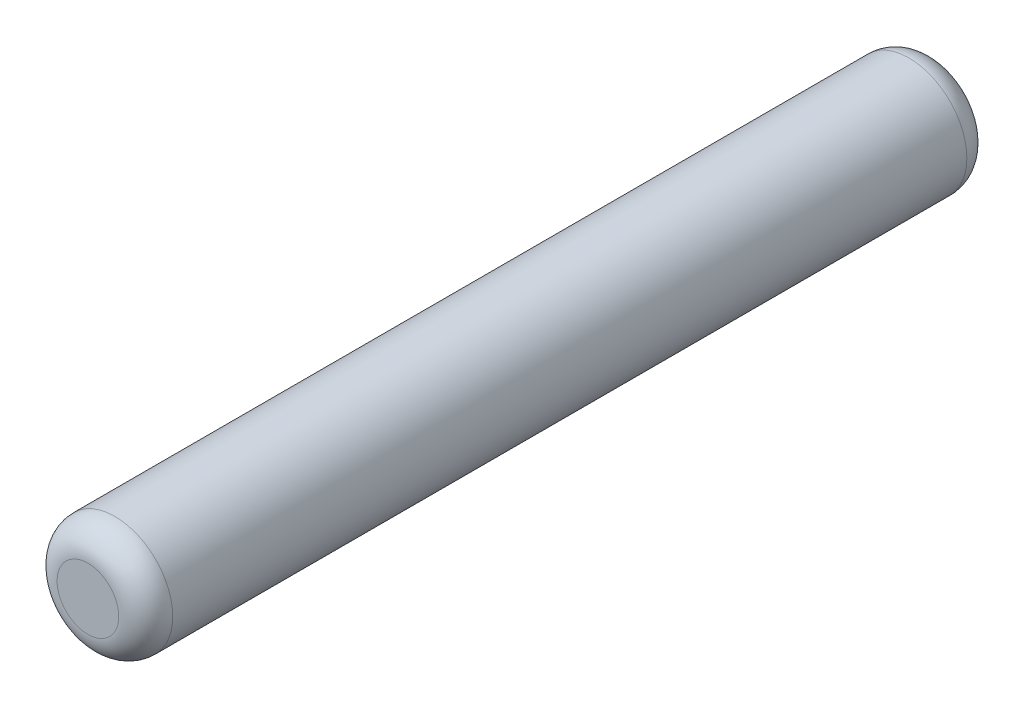
ISO-10303-21;
HEADER;
FILE_DESCRIPTION(('STEP AP214'),'2;1');
FILE_NAME('part.step','',(''),(''),'','','');
FILE_SCHEMA(('AUTOMOTIVE_DESIGN { 1 0 10303 214 1 1 1 1 }'));
ENDSEC;
DATA;
#1=APPLICATION_CONTEXT('core data for automotive mechanical design processes');
#2=APPLICATION_PROTOCOL_DEFINITION('international standard','automotive_design',2000,#1);
#3=PRODUCT_CONTEXT('',#1,'mechanical');
#4=PRODUCT('Part','Part','',(#3));
#5=PRODUCT_RELATED_PRODUCT_CATEGORY('part','',(#4));
#6=PRODUCT_DEFINITION_FORMATION('','',#4);
#7=PRODUCT_DEFINITION_CONTEXT('part definition',#1,'design');
#8=PRODUCT_DEFINITION('design','',#6,#7);
#9=PRODUCT_DEFINITION_SHAPE('','',#8);
#10=(LENGTH_UNIT() NAMED_UNIT(*) SI_UNIT(.MILLI.,.METRE.));
#11=(NAMED_UNIT(*) PLANE_ANGLE_UNIT() SI_UNIT($,.RADIAN.));
#12=(NAMED_UNIT(*) SI_UNIT($,.STERADIAN.) SOLID_ANGLE_UNIT());
#13=UNCERTAINTY_MEASURE_WITH_UNIT(LENGTH_MEASURE(1.E-05),#10,'distance_accuracy_value','');
#14=(GEOMETRIC_REPRESENTATION_CONTEXT(3) GLOBAL_UNCERTAINTY_ASSIGNED_CONTEXT((#13)) GLOBAL_UNIT_ASSIGNED_CONTEXT((#10,
#11,#12)) REPRESENTATION_CONTEXT('',''));
#15=CARTESIAN_POINT('',(0.,0.,0.));
#16=DIRECTION('',(0.,0.,1.));
#17=DIRECTION('',(1.,0.,0.));
#18=AXIS2_PLACEMENT_3D('',#15,#16,#17);
#19=CARTESIAN_POINT('',(0.,0.,5.5));
#20=DIRECTION('',(0.,0.,-1.));
#21=DIRECTION('',(-1.,0.,0.));
#22=AXIS2_PLACEMENT_3D('',#19,#20,#21);
#23=CYLINDRICAL_SURFACE('',#22,0.75);
#24=CARTESIAN_POINT('',(0.,0.,-5.15));
#25=DIRECTION('',(0.,0.,1.));
#26=DIRECTION('',(1.,0.,0.));
#27=AXIS2_PLACEMENT_3D('',#24,#25,#26);
#28=CIRCLE('',#27,0.75);
#29=CARTESIAN_POINT('',(0.75,0.,-5.15));
#30=VERTEX_POINT('',#29);
#31=EDGE_CURVE('E42',#30,#30,#28,.T.);
#32=ORIENTED_EDGE('',*,*,#31,.T.);
#33=EDGE_LOOP('',(#32));
#34=FACE_BOUND('',#33,.T.);
#35=CARTESIAN_POINT('',(0.,0.,5.15));
#36=DIRECTION('',(0.,0.,1.));
#37=DIRECTION('',(1.,0.,0.));
#38=AXIS2_PLACEMENT_3D('',#35,#36,#37);
#39=CIRCLE('',#38,0.75);
#40=CARTESIAN_POINT('',(0.75,0.,5.15));
#41=VERTEX_POINT('',#40);
#42=EDGE_CURVE('E46',#41,#41,#39,.F.);
#43=ORIENTED_EDGE('',*,*,#42,.T.);
#44=EDGE_LOOP('',(#43));
#45=FACE_BOUND('',#44,.T.);
#46=ADVANCED_FACE('F31',(#34,#45),#23,.T.);
#47=CARTESIAN_POINT('',(0.,0.,5.5));
#48=DIRECTION('',(0.,0.,1.));
#49=DIRECTION('',(1.,0.,0.));
#50=AXIS2_PLACEMENT_3D('',#47,#48,#49);
#51=PLANE('',#50);
#52=CARTESIAN_POINT('',(0.,0.,5.5));
#53=DIRECTION('',(0.,0.,1.));
#54=DIRECTION('',(1.,0.,0.));
#55=AXIS2_PLACEMENT_3D('',#52,#53,#54);
#56=CIRCLE('',#55,0.4);
#57=CARTESIAN_POINT('',(0.4,0.,5.5));
#58=VERTEX_POINT('',#57);
#59=EDGE_CURVE('E10',#58,#58,#56,.T.);
#60=ORIENTED_EDGE('',*,*,#59,.T.);
#61=EDGE_LOOP('',(#60));
#62=FACE_BOUND('',#61,.T.);
#63=ADVANCED_FACE('F62',(#62),#51,.T.);
#64=CARTESIAN_POINT('',(0.,0.,-5.5));
#65=DIRECTION('',(0.,0.,1.));
#66=DIRECTION('',(1.,0.,0.));
#67=AXIS2_PLACEMENT_3D('',#64,#65,#66);
#68=PLANE('',#67);
#69=CARTESIAN_POINT('',(0.,0.,-5.5));
#70=DIRECTION('',(0.,0.,1.));
#71=DIRECTION('',(1.,0.,0.));
#72=AXIS2_PLACEMENT_3D('',#69,#70,#71);
#73=CIRCLE('',#72,0.4);
#74=CARTESIAN_POINT('',(0.4,0.,-5.5));
#75=VERTEX_POINT('',#74);
#76=EDGE_CURVE('E38',#75,#75,#73,.F.);
#77=ORIENTED_EDGE('',*,*,#76,.T.);
#78=EDGE_LOOP('',(#77));
#79=FACE_BOUND('',#78,.T.);
#80=ADVANCED_FACE('F59',(#79),#68,.F.);
#81=CARTESIAN_POINT('',(0.,0.,-5.15));
#82=DIRECTION('',(0.,0.,1.));
#83=DIRECTION('',(1.,0.,0.));
#84=AXIS2_PLACEMENT_3D('',#81,#82,#83);
#85=TOROIDAL_SURFACE('',#84,0.4,0.35);
#86=ORIENTED_EDGE('',*,*,#76,.F.);
#87=EDGE_LOOP('',(#86));
#88=FACE_BOUND('',#87,.T.);
#89=ORIENTED_EDGE('',*,*,#31,.F.);
#90=EDGE_LOOP('',(#89));
#91=FACE_BOUND('',#90,.T.);
#92=ADVANCED_FACE('F55',(#88,#91),#85,.T.);
#93=CARTESIAN_POINT('',(0.,0.,5.15));
#94=DIRECTION('',(0.,0.,1.));
#95=DIRECTION('',(1.,0.,0.));
#96=AXIS2_PLACEMENT_3D('',#93,#94,#95);
#97=TOROIDAL_SURFACE('',#96,0.4,0.35);
#98=ORIENTED_EDGE('',*,*,#42,.F.);
#99=EDGE_LOOP('',(#98));
#100=FACE_BOUND('',#99,.T.);
#101=ORIENTED_EDGE('',*,*,#59,.F.);
#102=EDGE_LOOP('',(#101));
#103=FACE_BOUND('',#102,.T.);
#104=ADVANCED_FACE('F33',(#100,#103),#97,.T.);
#105=CLOSED_SHELL('',(#46,#63,#80,#92,#104));
#106=MANIFOLD_SOLID_BREP('B2',#105);
#107=ADVANCED_BREP_SHAPE_REPRESENTATION('',(#18,#106),#14);
#108=SHAPE_DEFINITION_REPRESENTATION(#9,#107);
ENDSEC;
END-ISO-10303-21;
